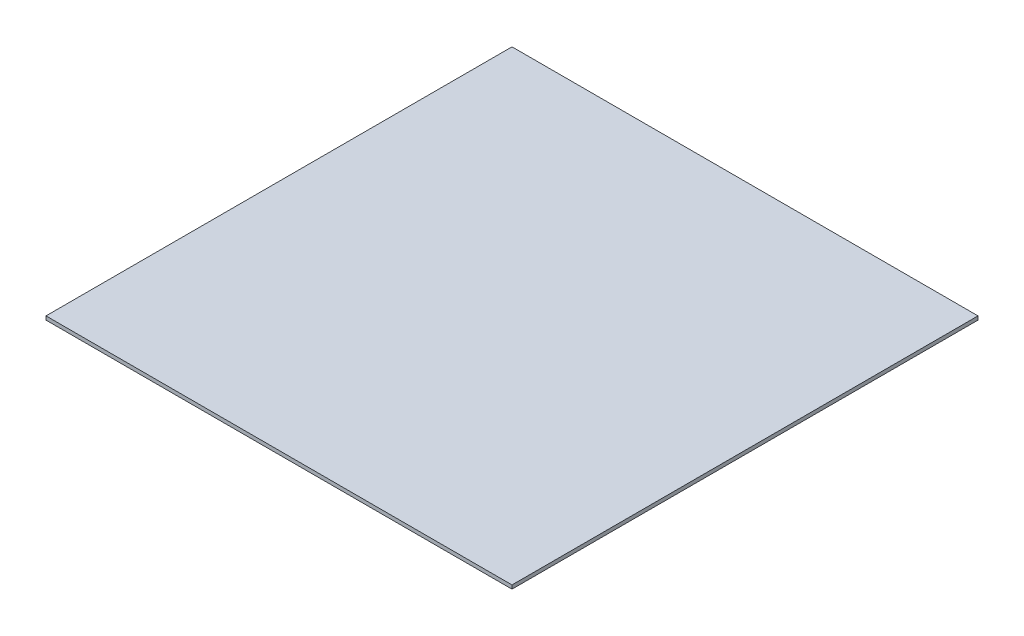
ISO-10303-21;
HEADER;
FILE_DESCRIPTION(('STEP AP214'),'2;1');
FILE_NAME('part.step','',(''),(''),'','','');
FILE_SCHEMA(('AUTOMOTIVE_DESIGN { 1 0 10303 214 1 1 1 1 }'));
ENDSEC;
DATA;
#1=APPLICATION_CONTEXT('core data for automotive mechanical design processes');
#2=APPLICATION_PROTOCOL_DEFINITION('international standard','automotive_design',2000,#1);
#3=PRODUCT_CONTEXT('',#1,'mechanical');
#4=PRODUCT('Part','Part','',(#3));
#5=PRODUCT_RELATED_PRODUCT_CATEGORY('part','',(#4));
#6=PRODUCT_DEFINITION_FORMATION('','',#4);
#7=PRODUCT_DEFINITION_CONTEXT('part definition',#1,'design');
#8=PRODUCT_DEFINITION('design','',#6,#7);
#9=PRODUCT_DEFINITION_SHAPE('','',#8);
#10=(LENGTH_UNIT() NAMED_UNIT(*) SI_UNIT(.MILLI.,.METRE.));
#11=(NAMED_UNIT(*) PLANE_ANGLE_UNIT() SI_UNIT($,.RADIAN.));
#12=(NAMED_UNIT(*) SI_UNIT($,.STERADIAN.) SOLID_ANGLE_UNIT());
#13=UNCERTAINTY_MEASURE_WITH_UNIT(LENGTH_MEASURE(1.E-05),#10,'distance_accuracy_value','');
#14=(GEOMETRIC_REPRESENTATION_CONTEXT(3) GLOBAL_UNCERTAINTY_ASSIGNED_CONTEXT((#13)) GLOBAL_UNIT_ASSIGNED_CONTEXT((#10,
#11,#12)) REPRESENTATION_CONTEXT('',''));
#15=CARTESIAN_POINT('',(0.,0.,0.));
#16=DIRECTION('',(0.,0.,1.));
#17=DIRECTION('',(1.,0.,0.));
#18=AXIS2_PLACEMENT_3D('',#15,#16,#17);
#19=CARTESIAN_POINT('',(252.5,4.,252.5));
#20=DIRECTION('',(-1.,0.,0.));
#21=DIRECTION('',(0.,0.,1.));
#22=AXIS2_PLACEMENT_3D('',#19,#20,#21);
#23=PLANE('',#22);
#24=DIRECTION('',(0.,0.,-1.));
#25=VECTOR('',#24,1.);
#26=CARTESIAN_POINT('',(252.5,0.,252.5));
#27=LINE('',#26,#25);
#28=CARTESIAN_POINT('',(252.5,0.,252.5));
#29=VERTEX_POINT('',#28);
#30=CARTESIAN_POINT('',(252.5,0.,-252.5));
#31=VERTEX_POINT('',#30);
#32=EDGE_CURVE('E95',#29,#31,#27,.T.);
#33=ORIENTED_EDGE('',*,*,#32,.T.);
#34=DIRECTION('',(0.,-1.,0.));
#35=VECTOR('',#34,1.);
#36=CARTESIAN_POINT('',(252.5,4.,-252.5));
#37=LINE('',#36,#35);
#38=CARTESIAN_POINT('',(252.5,4.,-252.5));
#39=VERTEX_POINT('',#38);
#40=EDGE_CURVE('E11',#39,#31,#37,.T.);
#41=ORIENTED_EDGE('',*,*,#40,.F.);
#42=DIRECTION('',(0.,0.,-1.));
#43=VECTOR('',#42,1.);
#44=CARTESIAN_POINT('',(252.5,4.,252.5));
#45=LINE('',#44,#43);
#46=CARTESIAN_POINT('',(252.5,4.,252.5));
#47=VERTEX_POINT('',#46);
#48=EDGE_CURVE('E83',#47,#39,#45,.T.);
#49=ORIENTED_EDGE('',*,*,#48,.F.);
#50=DIRECTION('',(0.,-1.,0.));
#51=VECTOR('',#50,1.);
#52=CARTESIAN_POINT('',(252.5,4.,252.5));
#53=LINE('',#52,#51);
#54=EDGE_CURVE('E91',#47,#29,#53,.T.);
#55=ORIENTED_EDGE('',*,*,#54,.T.);
#56=EDGE_LOOP('',(#33,#41,#49,#55));
#57=FACE_BOUND('',#56,.T.);
#58=ADVANCED_FACE('F32',(#57),#23,.F.);
#59=CARTESIAN_POINT('',(-252.5,4.,-252.5));
#60=DIRECTION('',(0.,0.,1.));
#61=DIRECTION('',(1.,0.,0.));
#62=AXIS2_PLACEMENT_3D('',#59,#60,#61);
#63=PLANE('',#62);
#64=DIRECTION('',(-1.,0.,0.));
#65=VECTOR('',#64,1.);
#66=CARTESIAN_POINT('',(-252.5,0.,-252.5));
#67=LINE('',#66,#65);
#68=CARTESIAN_POINT('',(-252.5,0.,-252.5));
#69=VERTEX_POINT('',#68);
#70=EDGE_CURVE('E87',#31,#69,#67,.T.);
#71=ORIENTED_EDGE('',*,*,#70,.T.);
#72=DIRECTION('',(0.,-1.,0.));
#73=VECTOR('',#72,1.);
#74=CARTESIAN_POINT('',(-252.5,4.,-252.5));
#75=LINE('',#74,#73);
#76=CARTESIAN_POINT('',(-252.5,4.,-252.5));
#77=VERTEX_POINT('',#76);
#78=EDGE_CURVE('E40',#77,#69,#75,.T.);
#79=ORIENTED_EDGE('',*,*,#78,.F.);
#80=DIRECTION('',(-1.,0.,0.));
#81=VECTOR('',#80,1.);
#82=CARTESIAN_POINT('',(-252.5,4.,-252.5));
#83=LINE('',#82,#81);
#84=EDGE_CURVE('E78',#39,#77,#83,.T.);
#85=ORIENTED_EDGE('',*,*,#84,.F.);
#86=ORIENTED_EDGE('',*,*,#40,.T.);
#87=EDGE_LOOP('',(#71,#79,#85,#86));
#88=FACE_BOUND('',#87,.T.);
#89=ADVANCED_FACE('F86',(#88),#63,.F.);
#90=CARTESIAN_POINT('',(-252.5,4.,252.5));
#91=DIRECTION('',(1.,0.,0.));
#92=DIRECTION('',(0.,0.,-1.));
#93=AXIS2_PLACEMENT_3D('',#90,#91,#92);
#94=PLANE('',#93);
#95=DIRECTION('',(0.,0.,1.));
#96=VECTOR('',#95,1.);
#97=CARTESIAN_POINT('',(-252.5,0.,252.5));
#98=LINE('',#97,#96);
#99=CARTESIAN_POINT('',(-252.5,0.,252.5));
#100=VERTEX_POINT('',#99);
#101=EDGE_CURVE('E65',#69,#100,#98,.T.);
#102=ORIENTED_EDGE('',*,*,#101,.T.);
#103=DIRECTION('',(0.,-1.,0.));
#104=VECTOR('',#103,1.);
#105=CARTESIAN_POINT('',(-252.5,4.,252.5));
#106=LINE('',#105,#104);
#107=CARTESIAN_POINT('',(-252.5,4.,252.5));
#108=VERTEX_POINT('',#107);
#109=EDGE_CURVE('E88',#108,#100,#106,.T.);
#110=ORIENTED_EDGE('',*,*,#109,.F.);
#111=DIRECTION('',(0.,0.,1.));
#112=VECTOR('',#111,1.);
#113=CARTESIAN_POINT('',(-252.5,4.,252.5));
#114=LINE('',#113,#112);
#115=EDGE_CURVE('E81',#77,#108,#114,.T.);
#116=ORIENTED_EDGE('',*,*,#115,.F.);
#117=ORIENTED_EDGE('',*,*,#78,.T.);
#118=EDGE_LOOP('',(#102,#110,#116,#117));
#119=FACE_BOUND('',#118,.T.);
#120=ADVANCED_FACE('F89',(#119),#94,.F.);
#121=CARTESIAN_POINT('',(-252.5,4.,252.5));
#122=DIRECTION('',(0.,0.,-1.));
#123=DIRECTION('',(-1.,0.,0.));
#124=AXIS2_PLACEMENT_3D('',#121,#122,#123);
#125=PLANE('',#124);
#126=DIRECTION('',(1.,0.,0.));
#127=VECTOR('',#126,1.);
#128=CARTESIAN_POINT('',(-252.5,0.,252.5));
#129=LINE('',#128,#127);
#130=EDGE_CURVE('E71',#100,#29,#129,.T.);
#131=ORIENTED_EDGE('',*,*,#130,.T.);
#132=ORIENTED_EDGE('',*,*,#54,.F.);
#133=DIRECTION('',(1.,0.,0.));
#134=VECTOR('',#133,1.);
#135=CARTESIAN_POINT('',(-252.5,4.,252.5));
#136=LINE('',#135,#134);
#137=EDGE_CURVE('E48',#108,#47,#136,.T.);
#138=ORIENTED_EDGE('',*,*,#137,.F.);
#139=ORIENTED_EDGE('',*,*,#109,.T.);
#140=EDGE_LOOP('',(#131,#132,#138,#139));
#141=FACE_BOUND('',#140,.T.);
#142=ADVANCED_FACE('F102',(#141),#125,.F.);
#143=CARTESIAN_POINT('',(0.,4.,0.));
#144=DIRECTION('',(0.,-1.,0.));
#145=DIRECTION('',(0.,0.,-1.));
#146=AXIS2_PLACEMENT_3D('',#143,#144,#145);
#147=PLANE('',#146);
#148=ORIENTED_EDGE('',*,*,#48,.T.);
#149=ORIENTED_EDGE('',*,*,#84,.T.);
#150=ORIENTED_EDGE('',*,*,#115,.T.);
#151=ORIENTED_EDGE('',*,*,#137,.T.);
#152=EDGE_LOOP('',(#148,#149,#150,#151));
#153=FACE_BOUND('',#152,.T.);
#154=ADVANCED_FACE('F79',(#153),#147,.F.);
#155=CARTESIAN_POINT('',(0.,0.,0.));
#156=DIRECTION('',(0.,-1.,0.));
#157=DIRECTION('',(0.,0.,-1.));
#158=AXIS2_PLACEMENT_3D('',#155,#156,#157);
#159=PLANE('',#158);
#160=ORIENTED_EDGE('',*,*,#32,.F.);
#161=ORIENTED_EDGE('',*,*,#130,.F.);
#162=ORIENTED_EDGE('',*,*,#101,.F.);
#163=ORIENTED_EDGE('',*,*,#70,.F.);
#164=EDGE_LOOP('',(#160,#161,#162,#163));
#165=FACE_BOUND('',#164,.T.);
#166=ADVANCED_FACE('F105',(#165),#159,.T.);
#167=CLOSED_SHELL('',(#58,#89,#120,#142,#154,#166));
#168=MANIFOLD_SOLID_BREP('B2',#167);
#169=ADVANCED_BREP_SHAPE_REPRESENTATION('',(#18,#168),#14);
#170=SHAPE_DEFINITION_REPRESENTATION(#9,#169);
ENDSEC;
END-ISO-10303-21;
